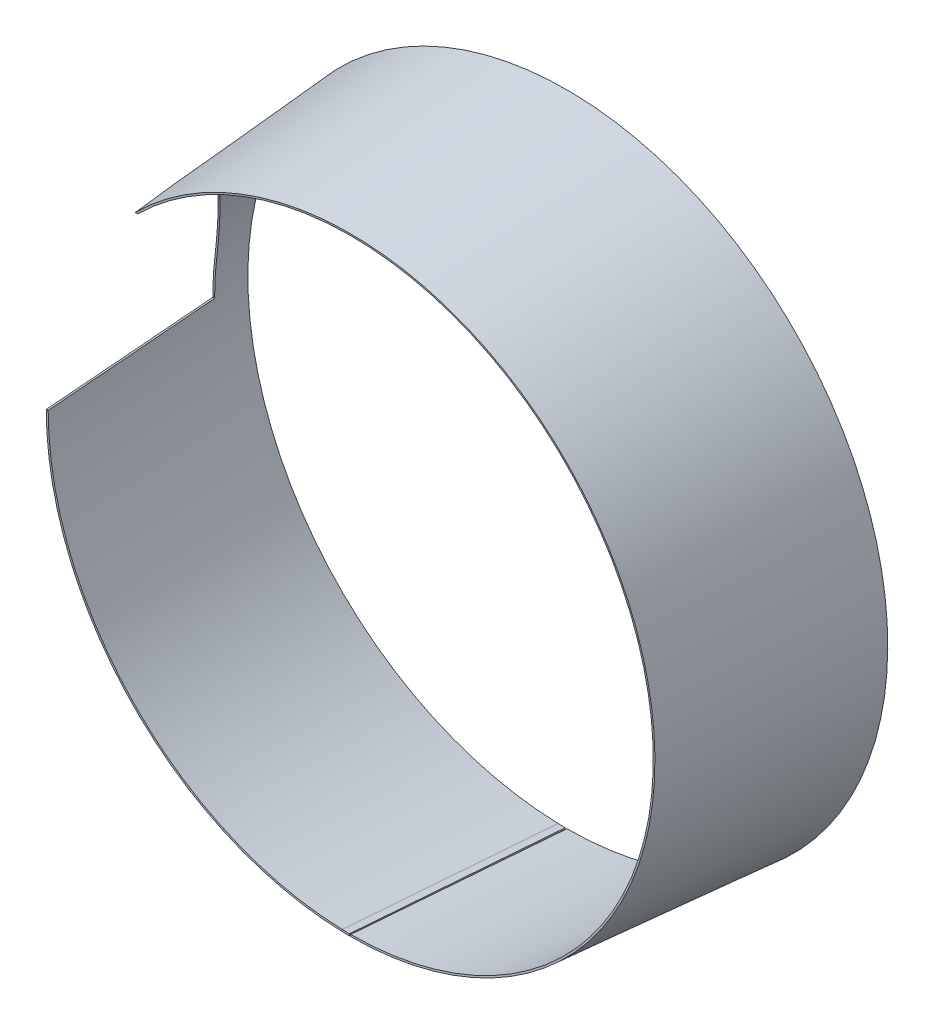
ISO-10303-21;
HEADER;
FILE_DESCRIPTION(('STEP AP214'),'2;1');
FILE_NAME('part.step','',(''),(''),'','','');
FILE_SCHEMA(('AUTOMOTIVE_DESIGN { 1 0 10303 214 1 1 1 1 }'));
ENDSEC;
DATA;
#1=APPLICATION_CONTEXT('core data for automotive mechanical design processes');
#2=APPLICATION_PROTOCOL_DEFINITION('international standard','automotive_design',2000,#1);
#3=PRODUCT_CONTEXT('',#1,'mechanical');
#4=PRODUCT('Part','Part','',(#3));
#5=PRODUCT_RELATED_PRODUCT_CATEGORY('part','',(#4));
#6=PRODUCT_DEFINITION_FORMATION('','',#4);
#7=PRODUCT_DEFINITION_CONTEXT('part definition',#1,'design');
#8=PRODUCT_DEFINITION('design','',#6,#7);
#9=PRODUCT_DEFINITION_SHAPE('','',#8);
#10=(LENGTH_UNIT() NAMED_UNIT(*) SI_UNIT(.MILLI.,.METRE.));
#11=(NAMED_UNIT(*) PLANE_ANGLE_UNIT() SI_UNIT($,.RADIAN.));
#12=(NAMED_UNIT(*) SI_UNIT($,.STERADIAN.) SOLID_ANGLE_UNIT());
#13=UNCERTAINTY_MEASURE_WITH_UNIT(LENGTH_MEASURE(1.E-05),#10,'distance_accuracy_value','');
#14=(GEOMETRIC_REPRESENTATION_CONTEXT(3) GLOBAL_UNCERTAINTY_ASSIGNED_CONTEXT((#13)) GLOBAL_UNIT_ASSIGNED_CONTEXT((#10,
#11,#12)) REPRESENTATION_CONTEXT('',''));
#15=CARTESIAN_POINT('',(0.,0.,0.));
#16=DIRECTION('',(0.,0.,1.));
#17=DIRECTION('',(1.,0.,0.));
#18=AXIS2_PLACEMENT_3D('',#15,#16,#17);
#19=CARTESIAN_POINT('',(0.,0.,241.5));
#20=DIRECTION('',(0.,0.,1.));
#21=DIRECTION('',(1.,0.,0.));
#22=AXIS2_PLACEMENT_3D('',#19,#20,#21);
#23=CONICAL_SURFACE('',#22,339.9,1.494341091626);
#24=DIRECTION('',(0.997078721927596,0.,-0.0763807716590501));
#25=VECTOR('',#24,1.);
#26=CARTESIAN_POINT('',(0.,0.,215.462111801242));
#27=LINE('',#26,#25);
#28=CARTESIAN_POINT('',(-337.905842556145,0.,241.347238456682));
#29=VERTEX_POINT('',#28);
#30=CARTESIAN_POINT('',(-339.9,0.,241.5));
#31=VERTEX_POINT('',#30);
#32=EDGE_CURVE('E225',#29,#31,#27,.F.);
#33=ORIENTED_EDGE('',*,*,#32,.T.);
#34=CARTESIAN_POINT('',(0.,0.,241.5));
#35=DIRECTION('',(0.,0.,1.));
#36=DIRECTION('',(1.,0.,0.));
#37=AXIS2_PLACEMENT_3D('',#34,#35,#36);
#38=CIRCLE('',#37,339.9);
#39=CARTESIAN_POINT('',(-9.48289401400218,-339.767692285654,241.5));
#40=VERTEX_POINT('',#39);
#41=EDGE_CURVE('E137',#31,#40,#38,.T.);
#42=ORIENTED_EDGE('',*,*,#41,.T.);
#43=DIRECTION('',(0.0278175694135114,0.996690604226152,-0.0763807716590499));
#44=VECTOR('',#43,1.);
#45=CARTESIAN_POINT('',(-9.48289401400218,-339.767692285654,241.5));
#46=LINE('',#45,#44);
#47=CARTESIAN_POINT('',(-9.42725887517516,-337.774311077202,241.347238456682));
#48=VERTEX_POINT('',#47);
#49=EDGE_CURVE('E52',#40,#48,#46,.T.);
#50=ORIENTED_EDGE('',*,*,#49,.T.);
#51=CARTESIAN_POINT('',(0.,0.,241.347238456682));
#52=DIRECTION('',(0.,0.,-1.));
#53=DIRECTION('',(-1.,0.,0.));
#54=AXIS2_PLACEMENT_3D('',#51,#52,#53);
#55=CIRCLE('',#54,337.905842556145);
#56=EDGE_CURVE('E135',#29,#48,#55,.F.);
#57=ORIENTED_EDGE('',*,*,#56,.F.);
#58=EDGE_LOOP('',(#33,#42,#50,#57));
#59=FACE_BOUND('',#58,.T.);
#60=ADVANCED_FACE('F43',(#59),#23,.F.);
#61=CARTESIAN_POINT('',(-543.840220596724,240.,260.999134219773));
#62=CARTESIAN_POINT('',(-537.646215797835,240.,260.565039646966));
#63=CARTESIAN_POINT('',(-531.452127179241,240.,260.132141443949));
#64=CARTESIAN_POINT('',(-519.063766615592,240.,259.268971534473));
#65=CARTESIAN_POINT('',(-512.869494670526,240.,258.838699828158));
#66=CARTESIAN_POINT('',(-494.286373475592,240.,257.552174616955));
#67=CARTESIAN_POINT('',(-481.897226718803,240.,256.700211570756));
#68=CARTESIAN_POINT('',(-457.117966386083,240.,255.010026911484));
#69=CARTESIAN_POINT('',(-444.727852807984,240.,254.171805330178));
#70=CARTESIAN_POINT('',(-419.946509401767,240.,252.512028451491));
#71=CARTESIAN_POINT('',(-407.555279573799,240.,251.69047315187));
#72=CARTESIAN_POINT('',(-382.756646163067,240.,250.06678660429));
#73=CARTESIAN_POINT('',(-370.349240978413,240.,249.264679790125));
#74=CARTESIAN_POINT('',(-345.53281798465,240.,247.685699005837));
#75=CARTESIAN_POINT('',(-333.12380017536,240.,246.908825038545));
#76=CARTESIAN_POINT('',(-314.50875632746,240.,245.76712813447));
#77=CARTESIAN_POINT('',(-308.303453939054,240.,245.390496121665));
#78=CARTESIAN_POINT('',(-295.892319477723,240.,244.646069547473));
#79=CARTESIAN_POINT('',(-289.686487404892,240.,244.278274984546));
#80=CARTESIAN_POINT('',(-277.274241678665,240.,243.552588125492));
#81=CARTESIAN_POINT('',(-271.067828025076,240.,243.194695832693));
#82=CARTESIAN_POINT('',(-258.654368708563,240.,242.490030368996));
#83=CARTESIAN_POINT('',(-252.447323045637,240.,242.143257198148));
#84=CARTESIAN_POINT('',(-240.050513368498,240.,241.463190242762));
#85=CARTESIAN_POINT('',(-233.860751338144,240.,241.129860346126));
#86=CARTESIAN_POINT('',(-221.480490214901,240.,240.477157495979));
#87=CARTESIAN_POINT('',(-215.289991122008,240.,240.15778454258));
#88=CARTESIAN_POINT('',(-202.908196988608,240.,239.534713561634));
#89=CARTESIAN_POINT('',(-196.716901947404,240.,239.231015547928));
#90=CARTESIAN_POINT('',(-184.333473097787,240.,238.641201089516));
#91=CARTESIAN_POINT('',(-178.14133928937,240.,238.355084644926));
#92=CARTESIAN_POINT('',(-165.756228277715,240.,237.802525588066));
#93=CARTESIAN_POINT('',(-159.563251079989,240.,237.536082852889));
#94=CARTESIAN_POINT('',(-147.176392633737,240.,237.025124379989));
#95=CARTESIAN_POINT('',(-140.982511384531,240.,236.780608658873));
#96=CARTESIAN_POINT('',(-122.399485772452,240.,236.083536833456));
#97=CARTESIAN_POINT('',(-110.008924306537,240.,235.6674544681));
#98=CARTESIAN_POINT('',(-91.4236888474713,240.,235.131049828325));
#99=CARTESIAN_POINT('',(-85.2302598562439,240.,234.966898185531));
#100=CARTESIAN_POINT('',(-72.8426394334188,240.,234.67007531818));
#101=CARTESIAN_POINT('',(-66.6484480018408,240.,234.537404092812));
#102=CARTESIAN_POINT('',(-54.2594360501224,240.,234.30558795242));
#103=CARTESIAN_POINT('',(-48.0646155300205,240.,234.206443035353));
#104=CARTESIAN_POINT('',(-35.67450986364,240.,234.043324662046));
#105=CARTESIAN_POINT('',(-29.4792247174673,240.,233.97935119781));
#106=CARTESIAN_POINT('',(-17.0885869807392,240.,233.887696859553));
#107=CARTESIAN_POINT('',(-10.8932343990035,240.,233.860014799631));
#108=CARTESIAN_POINT('',(1.49753009656107,240.,233.841438831701));
#109=CARTESIAN_POINT('',(7.69294201042204,240.,233.850544944972));
#110=CARTESIAN_POINT('',(20.0835664601539,240.,233.905379216342));
#111=CARTESIAN_POINT('',(26.2787789969624,240.,233.951107164999));
#112=CARTESIAN_POINT('',(38.6688241320087,240.,234.078372620152));
#113=CARTESIAN_POINT('',(44.8636567310335,240.,234.159910049791));
#114=CARTESIAN_POINT('',(54.2437644154056,240.,234.309427239505));
#115=CARTESIAN_POINT('',(57.4292469085065,240.,234.364753731041));
#116=CARTESIAN_POINT('',(63.8000361891286,240.,234.484259700994));
#117=CARTESIAN_POINT('',(66.9853429771893,240.,234.548439150513));
#118=CARTESIAN_POINT('',(73.3557556245175,240.,234.68538641499));
#119=CARTESIAN_POINT('',(76.5408614847106,240.,234.758154186981));
#120=CARTESIAN_POINT('',(82.9108746892457,240.,234.911988095174));
#121=CARTESIAN_POINT('',(86.095782033417,240.,234.993054238423));
#122=CARTESIAN_POINT('',(95.650847343735,240.,235.248260674254));
#123=CARTESIAN_POINT('',(102.020688104221,240.,235.434394649638));
#124=CARTESIAN_POINT('',(114.759442097386,240.,235.836046990548));
#125=CARTESIAN_POINT('',(121.128355329127,240.,236.05156538557));
#126=CARTESIAN_POINT('',(133.869425706447,240.,236.509461975708));
#127=CARTESIAN_POINT('',(140.241582215871,240.,236.751857819013));
#128=CARTESIAN_POINT('',(152.984933337777,240.,237.260762270586));
#129=CARTESIAN_POINT('',(159.356127949604,240.,237.527270895159));
#130=CARTESIAN_POINT('',(172.096671627331,240.,238.081838650728));
#131=CARTESIAN_POINT('',(178.466020826816,240.,238.369894724413));
#132=CARTESIAN_POINT('',(191.203796551716,240.,238.965296522566));
#133=CARTESIAN_POINT('',(197.572223080261,240.,239.272642180011));
#134=CARTESIAN_POINT('',(203.940220596724,240.,239.588486635848));
#135=B_SPLINE_CURVE_WITH_KNOTS('',3,(#61,#62,#63,#64,#65,#66,#67,#68,#69,#70,#71,#72,#73,#74,
#75,#76,#77,#78,#79,#80,#81,#82,#83,#84,#85,#86,#87,#88,#89,#90,#91,#92,#93,#94,#95,#96,#97,#98,
#99,#100,#101,#102,#103,#104,#105,#106,#107,#108,#109,#110,#111,#112,#113,#114,#115,#116,#117,
#118,#119,#120,#121,#122,#123,#124,#125,#126,#127,#128,#129,#130,#131,#132,#133,#134),
.UNSPECIFIED.,.F.,.F.,(4,2,2,2,2,2,2,2,2,2,2,2,2,2,2,2,2,2,2,2,2,2,2,2,2,2,2,2,2,2,2,2,2,2,2,2,
4),(0.,18.627592266517,37.2551855493778,74.5103957314578,111.765692028904,149.020983318087,
186.320879764651,223.620780396903,242.270940574708,260.921097501024,279.571260697403,
298.221423978873,316.817602209989,335.413780590301,354.009975391076,372.606170314153,
391.202249051697,409.798341872302,446.990421691351,465.577170005147,484.163917840524,
502.750664543436,521.337407020268,539.923542118785,558.509687967379,577.095727521214,
595.681727184981,605.239605735957,614.797453087601,624.355252624011,633.913060277179,
653.030657476456,672.148273866796,691.278518388477,710.408775847658,729.536324094403,
748.663805884229),.UNSPECIFIED.);
#136=CARTESIAN_POINT('',(-240.690693629812,240.,241.5));
#137=VERTEX_POINT('',#136);
#138=CARTESIAN_POINT('',(-237.866261654691,240.,241.347238456682));
#139=VERTEX_POINT('',#138);
#140=EDGE_CURVE('E59',#137,#139,#135,.T.);
#141=ORIENTED_EDGE('',*,*,#140,.T.);
#142=CARTESIAN_POINT('',(0.,-337.905842556145,241.347238456682));
#143=VERTEX_POINT('',#142);
#144=EDGE_CURVE('E167',#143,#139,#55,.F.);
#145=ORIENTED_EDGE('',*,*,#144,.F.);
#146=DIRECTION('',(0.,0.997078721927596,-0.0763807716590501));
#147=VECTOR('',#146,1.);
#148=CARTESIAN_POINT('',(0.,-339.9,241.5));
#149=LINE('',#148,#147);
#150=CARTESIAN_POINT('',(0.,-339.9,241.5));
#151=VERTEX_POINT('',#150);
#152=EDGE_CURVE('E12',#151,#143,#149,.T.);
#153=ORIENTED_EDGE('',*,*,#152,.F.);
#154=EDGE_CURVE('E165',#151,#137,#38,.T.);
#155=ORIENTED_EDGE('',*,*,#154,.T.);
#156=EDGE_LOOP('',(#141,#145,#153,#155));
#157=FACE_BOUND('',#156,.T.);
#158=ADVANCED_FACE('F272',(#157),#23,.F.);
#159=CARTESIAN_POINT('',(-9.48289401400207,-339.767692285655,241.5));
#160=DIRECTION('',(0.00213095252236009,0.0763510400752954,0.997078721927596));
#161=DIRECTION('',(0.999610745176977,-0.0278990703559828,0.));
#162=AXIS2_PLACEMENT_3D('',#159,#160,#161);
#163=PLANE('',#162);
#164=ORIENTED_EDGE('',*,*,#49,.F.);
#165=DIRECTION('',(0.999610745176977,-0.0278990703559828,0.));
#166=VECTOR('',#165,1.);
#167=CARTESIAN_POINT('',(-9.48289401400207,-339.767692285655,241.5));
#168=LINE('',#167,#166);
#169=CARTESIAN_POINT('',(-1.48600805258626,-339.990884848502,241.5));
#170=VERTEX_POINT('',#169);
#171=EDGE_CURVE('E114',#40,#170,#168,.T.);
#172=ORIENTED_EDGE('',*,*,#171,.T.);
#173=DIRECTION('',(0.0278175694135114,0.996690604226152,-0.0763807716590499));
#174=VECTOR('',#173,1.);
#175=CARTESIAN_POINT('',(-1.48600805258626,-339.990884848502,241.5));
#176=LINE('',#175,#174);
#177=CARTESIAN_POINT('',(-1.43037291375924,-337.99750364005,241.347238456682));
#178=VERTEX_POINT('',#177);
#179=EDGE_CURVE('E95',#170,#178,#176,.T.);
#180=ORIENTED_EDGE('',*,*,#179,.T.);
#181=DIRECTION('',(0.999610745176977,-0.0278990703559828,0.));
#182=VECTOR('',#181,1.);
#183=CARTESIAN_POINT('',(-9.42725887517505,-337.774311077202,241.347238456682));
#184=LINE('',#183,#182);
#185=EDGE_CURVE('E139',#48,#178,#184,.T.);
#186=ORIENTED_EDGE('',*,*,#185,.F.);
#187=EDGE_LOOP('',(#164,#172,#180,#186));
#188=FACE_BOUND('',#187,.T.);
#189=ADVANCED_FACE('F119',(#188),#163,.T.);
#190=CARTESIAN_POINT('',(-1.99902681558801,-358.483770546889,0.));
#191=DIRECTION('',(-0.99961077250241,0.0278980883336495,-1.28243344317126E-05));
#192=DIRECTION('',(0.00211809562110294,0.0763513989042463,0.997078721845123));
#193=AXIS2_PLACEMENT_3D('',#190,#191,#192);
#194=PLANE('',#193);
#195=ORIENTED_EDGE('',*,*,#179,.F.);
#196=DIRECTION('',(0.00211809562110294,0.0763513989042463,0.997078721845123));
#197=VECTOR('',#196,1.);
#198=CARTESIAN_POINT('',(-1.99902681558801,-358.483770546889,0.));
#199=LINE('',#198,#197);
#200=CARTESIAN_POINT('',(-1.99902681558801,-358.483770546889,0.));
#201=VERTEX_POINT('',#200);
#202=EDGE_CURVE('E99',#201,#170,#199,.T.);
#203=ORIENTED_EDGE('',*,*,#202,.F.);
#204=DIRECTION('',(0.0278175694135114,0.996690604226152,-0.0763807716590499));
#205=VECTOR('',#204,1.);
#206=CARTESIAN_POINT('',(-1.99902681558801,-358.483770546889,0.));
#207=LINE('',#206,#205);
#208=CARTESIAN_POINT('',(-1.94339167676099,-356.490389338437,-0.152761543318091));
#209=VERTEX_POINT('',#208);
#210=EDGE_CURVE('E107',#201,#209,#207,.T.);
#211=ORIENTED_EDGE('',*,*,#210,.T.);
#212=DIRECTION('',(0.00211809562110294,0.0763513989042463,0.997078721845123));
#213=VECTOR('',#212,1.);
#214=CARTESIAN_POINT('',(-1.94339167676099,-356.490389338437,-0.152761543318102));
#215=LINE('',#214,#213);
#216=EDGE_CURVE('E102',#209,#178,#215,.T.);
#217=ORIENTED_EDGE('',*,*,#216,.T.);
#218=EDGE_LOOP('',(#195,#203,#211,#217));
#219=FACE_BOUND('',#218,.T.);
#220=ADVANCED_FACE('F97',(#219),#194,.F.);
#221=CARTESIAN_POINT('',(-9.99902681558802,-358.260491071429,0.));
#222=DIRECTION('',(0.00213095252236022,0.0763510400752954,0.997078721927596));
#223=DIRECTION('',(0.999610745176977,-0.0278990703559844,0.));
#224=AXIS2_PLACEMENT_3D('',#221,#222,#223);
#225=PLANE('',#224);
#226=ORIENTED_EDGE('',*,*,#210,.F.);
#227=DIRECTION('',(0.999610745176977,-0.0278990703559844,0.));
#228=VECTOR('',#227,1.);
#229=CARTESIAN_POINT('',(-9.99902681558802,-358.260491071429,0.));
#230=LINE('',#229,#228);
#231=CARTESIAN_POINT('',(-9.99902681558806,-358.260491071429,0.));
#232=VERTEX_POINT('',#231);
#233=EDGE_CURVE('E116',#232,#201,#230,.T.);
#234=ORIENTED_EDGE('',*,*,#233,.F.);
#235=DIRECTION('',(0.027817569413522,0.996690604226152,-0.0763807716590501));
#236=VECTOR('',#235,1.);
#237=CARTESIAN_POINT('',(-9.99902681558806,-358.260491071429,0.));
#238=LINE('',#237,#236);
#239=CARTESIAN_POINT('',(-9.94339167676104,-356.267109862976,-0.152761543318093));
#240=VERTEX_POINT('',#239);
#241=EDGE_CURVE('E127',#232,#240,#238,.T.);
#242=ORIENTED_EDGE('',*,*,#241,.T.);
#243=DIRECTION('',(0.999610745176977,-0.0278990703559844,0.));
#244=VECTOR('',#243,1.);
#245=CARTESIAN_POINT('',(-9.94339167676099,-356.267109862976,-0.152761543318102));
#246=LINE('',#245,#244);
#247=EDGE_CURVE('E142',#240,#209,#246,.T.);
#248=ORIENTED_EDGE('',*,*,#247,.T.);
#249=EDGE_LOOP('',(#226,#234,#242,#248));
#250=FACE_BOUND('',#249,.T.);
#251=ADVANCED_FACE('F184',(#250),#225,.F.);
#252=CARTESIAN_POINT('',(0.,0.,0.));
#253=DIRECTION('',(0.,0.,1.));
#254=DIRECTION('',(1.,0.,0.));
#255=AXIS2_PLACEMENT_3D('',#252,#253,#254);
#256=CONICAL_SURFACE('',#255,358.4,1.494341091626);
#257=ORIENTED_EDGE('',*,*,#241,.F.);
#258=CARTESIAN_POINT('',(0.,0.,0.));
#259=DIRECTION('',(0.,0.,1.));
#260=DIRECTION('',(1.,0.,0.));
#261=AXIS2_PLACEMENT_3D('',#258,#259,#260);
#262=CIRCLE('',#261,358.4);
#263=CARTESIAN_POINT('',(0.,-358.4,0.));
#264=VERTEX_POINT('',#263);
#265=EDGE_CURVE('E173',#264,#232,#262,.T.);
#266=ORIENTED_EDGE('',*,*,#265,.F.);
#267=DIRECTION('',(0.,0.997078721927596,-0.0763807716590501));
#268=VECTOR('',#267,1.);
#269=CARTESIAN_POINT('',(0.,-358.4,0.));
#270=LINE('',#269,#268);
#271=CARTESIAN_POINT('',(0.,-356.405842556145,-0.152761543318099));
#272=VERTEX_POINT('',#271);
#273=EDGE_CURVE('E47',#264,#272,#270,.T.);
#274=ORIENTED_EDGE('',*,*,#273,.T.);
#275=CARTESIAN_POINT('',(0.,0.,-0.152761543318099));
#276=DIRECTION('',(0.,0.,-1.));
#277=DIRECTION('',(-1.,0.,0.));
#278=AXIS2_PLACEMENT_3D('',#275,#276,#277);
#279=CIRCLE('',#278,356.405842556145);
#280=EDGE_CURVE('E152',#272,#240,#279,.F.);
#281=ORIENTED_EDGE('',*,*,#280,.T.);
#282=EDGE_LOOP('',(#257,#266,#274,#281));
#283=FACE_BOUND('',#282,.T.);
#284=ADVANCED_FACE('F274',(#283),#256,.T.);
#285=CARTESIAN_POINT('',(0.,-358.4,0.));
#286=DIRECTION('',(1.,0.,0.));
#287=DIRECTION('',(0.,0.0763807716590501,0.997078721927596));
#288=AXIS2_PLACEMENT_3D('',#285,#286,#287);
#289=PLANE('',#288);
#290=DIRECTION('',(0.,0.0763807716590501,0.997078721927596));
#291=VECTOR('',#290,1.);
#292=CARTESIAN_POINT('',(0.,-358.4,0.));
#293=LINE('',#292,#291);
#294=EDGE_CURVE('E171',#264,#151,#293,.T.);
#295=ORIENTED_EDGE('',*,*,#294,.T.);
#296=ORIENTED_EDGE('',*,*,#152,.T.);
#297=DIRECTION('',(0.,-0.0763807716590501,-0.997078721927596));
#298=VECTOR('',#297,1.);
#299=CARTESIAN_POINT('',(0.,-356.405842556145,-0.1527615433181));
#300=LINE('',#299,#298);
#301=EDGE_CURVE('E154',#272,#143,#300,.F.);
#302=ORIENTED_EDGE('',*,*,#301,.F.);
#303=ORIENTED_EDGE('',*,*,#273,.F.);
#304=EDGE_LOOP('',(#295,#296,#302,#303));
#305=FACE_BOUND('',#304,.T.);
#306=ADVANCED_FACE('F45',(#305),#289,.F.);
#307=CARTESIAN_POINT('',(0.,0.,-0.1527615433181));
#308=DIRECTION('',(0.,0.,-1.));
#309=DIRECTION('',(-1.,0.,0.));
#310=AXIS2_PLACEMENT_3D('',#307,#308,#309);
#311=CONICAL_SURFACE('',#310,356.405842556145,0.0764552351688992);
#312=DIRECTION('',(-0.0763807716590501,0.,-0.997078721927596));
#313=VECTOR('',#312,1.);
#314=CARTESIAN_POINT('',(0.,-6.76861898362916E-13,4652.38837236526));
#315=LINE('',#314,#313);
#316=CARTESIAN_POINT('',(-353.329958131501,0.,40.0000000000001));
#317=VERTEX_POINT('',#316);
#318=EDGE_CURVE('E220',#317,#29,#315,.F.);
#319=ORIENTED_EDGE('',*,*,#318,.T.);
#320=ORIENTED_EDGE('',*,*,#56,.T.);
#321=DIRECTION('',(-0.00213095252236093,-0.0763510400752956,-0.997078721927596));
#322=VECTOR('',#321,1.);
#323=CARTESIAN_POINT('',(-9.94339167676111,-356.267109862976,-0.1527615433181));
#324=LINE('',#323,#322);
#325=EDGE_CURVE('E146',#240,#48,#324,.F.);
#326=ORIENTED_EDGE('',*,*,#325,.F.);
#327=ORIENTED_EDGE('',*,*,#280,.F.);
#328=ORIENTED_EDGE('',*,*,#301,.T.);
#329=ORIENTED_EDGE('',*,*,#144,.T.);
#330=CARTESIAN_POINT('',(-161.057756729506,240.,879.346672928448));
#331=CARTESIAN_POINT('',(-162.581764161245,240.,868.260492081893));
#332=CARTESIAN_POINT('',(-164.091228437712,240.,857.172317973561));
#333=CARTESIAN_POINT('',(-167.083155367084,240.,834.992338090914));
#334=CARTESIAN_POINT('',(-168.565618047567,240.,823.900532320321));
#335=CARTESIAN_POINT('',(-171.505621857814,240.,801.713679573142));
#336=CARTESIAN_POINT('',(-172.963163118395,240.,790.618632613881));
#337=CARTESIAN_POINT('',(-175.855109659939,240.,768.425522781952));
#338=CARTESIAN_POINT('',(-177.289514934209,240.,757.327459908412));
#339=CARTESIAN_POINT('',(-181.560438041611,240.,724.029552399986));
#340=CARTESIAN_POINT('',(-184.36471879637,240.,701.825568030029));
#341=CARTESIAN_POINT('',(-189.898308888849,240.,657.408243361391));
#342=CARTESIAN_POINT('',(-192.627618110569,240.,635.194903048288));
#343=CARTESIAN_POINT('',(-198.020024113377,240.,590.761366039557));
#344=CARTESIAN_POINT('',(-200.68312433215,240.,568.541169760807));
#345=CARTESIAN_POINT('',(-205.950660404845,240.,524.093840838631));
#346=CARTESIAN_POINT('',(-208.555096283732,240.,501.866708198161));
#347=CARTESIAN_POINT('',(-213.711516910172,240.,457.406288802446));
#348=CARTESIAN_POINT('',(-216.263501481164,240.,435.173002026741));
#349=CARTESIAN_POINT('',(-221.320276321987,240.,390.701068336075));
#350=CARTESIAN_POINT('',(-223.825066601155,240.,368.462421422175));
#351=CARTESIAN_POINT('',(-227.274759448738,240.,337.567869553406));
#352=CARTESIAN_POINT('',(-228.237781773979,240.,328.913983882255));
#353=CARTESIAN_POINT('',(-230.157593760954,240.,311.605530581409));
#354=CARTESIAN_POINT('',(-231.114383429492,240.,302.950962952468));
#355=CARTESIAN_POINT('',(-233.975758450524,240.,276.986180829358));
#356=CARTESIAN_POINT('',(-235.871340144735,240.,259.674973775912));
#357=CARTESIAN_POINT('',(-240.648382432695,240.,215.78763736811));
#358=CARTESIAN_POINT('',(-243.514704536001,240.,189.209859835797));
#359=CARTESIAN_POINT('',(-249.200042931942,240.,136.049240990704));
#360=CARTESIAN_POINT('',(-252.019059208907,240.,109.46639967625));
#361=CARTESIAN_POINT('',(-257.614306349982,240.,56.2961581951379));
#362=CARTESIAN_POINT('',(-260.390537121229,240.,29.7087580187124));
#363=CARTESIAN_POINT('',(-265.904115955675,240.,-23.4700741407788));
#364=CARTESIAN_POINT('',(-268.641464015489,240.,-50.0615061241952));
#365=CARTESIAN_POINT('',(-274.080622168583,240.,-103.247440851145));
#366=CARTESIAN_POINT('',(-276.782433004151,240.,-129.841943518797));
#367=CARTESIAN_POINT('',(-282.153551039514,240.,-183.034232577149));
#368=CARTESIAN_POINT('',(-284.822858236002,240.,-209.632018968182));
#369=CARTESIAN_POINT('',(-290.131593733517,240.,-262.830423238444));
#370=CARTESIAN_POINT('',(-292.771022200108,240.,-289.431041101158));
#371=CARTESIAN_POINT('',(-298.022285857229,240.,-342.634991887732));
#372=CARTESIAN_POINT('',(-300.634121056808,240.,-369.238324810698));
#373=CARTESIAN_POINT('',(-303.233295773689,240.,-395.842892058567));
#374=B_SPLINE_CURVE_WITH_KNOTS('',3,(#330,#331,#332,#333,#334,#335,#336,#337,#338,#339,#340,
#341,#342,#343,#344,#345,#346,#347,#348,#349,#350,#351,#352,#353,#354,#355,#356,#357,#358,#359,
#360,#361,#362,#363,#364,#365,#366,#367,#368,#369,#370,#371,#372,#373),.UNSPECIFIED.,.F.,.F.,(4,
2,2,2,2,2,2,2,2,2,2,2,2,2,2,2,2,2,2,2,2,4),(0.,33.571309299136,67.1425843101541,
100.713683044861,134.284791492603,201.425734870211,268.566782126862,335.704335993725,
402.841861290423,469.979612548718,537.117350525604,563.239262071252,589.361145090089,
641.605172773009,721.800799277013,801.996452345226,882.192279447541,962.388113528504,
1042.5822698367,1122.77643430051,1202.97015417142,1283.16384774102),.UNSPECIFIED.);
#375=CARTESIAN_POINT('',(-238.012848310633,240.,240.000000000001));
#376=VERTEX_POINT('',#375);
#377=EDGE_CURVE('E239',#139,#376,#374,.T.);
#378=ORIENTED_EDGE('',*,*,#377,.T.);
#379=CARTESIAN_POINT('',(-238.012826553057,239.9999999999,240.000200000001));
#380=CARTESIAN_POINT('',(-238.151664169441,240.000004184882,238.723893033011));
#381=CARTESIAN_POINT('',(-238.302627335958,239.987784390275,237.448973737179));
#382=CARTESIAN_POINT('',(-238.628354079354,239.939087316741,234.902674371969));
#383=CARTESIAN_POINT('',(-238.803117060767,239.902610644626,233.631294214855));
#384=CARTESIAN_POINT('',(-239.362323281523,239.757110733759,229.824314414939));
#385=CARTESIAN_POINT('',(-239.781772079668,239.61201735805,227.295068191574));
#386=CARTESIAN_POINT('',(-240.708274758523,239.228116342864,222.265684566022));
#387=CARTESIAN_POINT('',(-241.215139047102,238.989510123565,219.76549641375));
#388=CARTESIAN_POINT('',(-242.311656518273,238.42102537831,214.79370394375));
#389=CARTESIAN_POINT('',(-242.901314395911,238.091141675177,212.32210125565));
#390=CARTESIAN_POINT('',(-244.150548968362,237.346904294927,207.438770963954));
#391=CARTESIAN_POINT('',(-244.809297064724,236.933506575738,205.026684636552));
#392=CARTESIAN_POINT('',(-246.195736659943,236.022871324703,200.238550579169));
#393=CARTESIAN_POINT('',(-246.923426695686,235.525635571926,197.862502085621));
#394=CARTESIAN_POINT('',(-248.441987092742,234.449786415237,193.147778012726));
#395=CARTESIAN_POINT('',(-249.232894595729,233.871125017859,190.809125386963));
#396=CARTESIAN_POINT('',(-250.871353402416,232.635353104018,186.172709370834));
#397=CARTESIAN_POINT('',(-251.718907538927,231.978238662945,183.874948032664));
#398=CARTESIAN_POINT('',(-253.654831989591,230.436692821245,178.825908084713));
#399=CARTESIAN_POINT('',(-254.755434956288,229.533928647198,176.084902341998));
#400=CARTESIAN_POINT('',(-257.021283313873,227.62021849951,170.668149137111));
#401=CARTESIAN_POINT('',(-258.186532116814,226.609266813034,167.99240513025));
#402=CARTESIAN_POINT('',(-260.571926222607,224.483027417563,162.707530694596));
#403=CARTESIAN_POINT('',(-261.79207498516,223.367733128284,160.098404480227));
#404=CARTESIAN_POINT('',(-264.27805323071,221.036310679228,154.94798732422));
#405=CARTESIAN_POINT('',(-265.543882094685,219.820183885563,152.406695464155));
#406=CARTESIAN_POINT('',(-268.118741675353,217.284175609874,147.380994745585));
#407=CARTESIAN_POINT('',(-269.427945787329,215.963838325841,144.896905027238));
#408=CARTESIAN_POINT('',(-272.075977912884,213.226957216017,139.99853759686));
#409=CARTESIAN_POINT('',(-273.414806033211,211.810413043515,137.584260136465));
#410=CARTESIAN_POINT('',(-276.114599092897,208.883414366586,132.826341360192));
#411=CARTESIAN_POINT('',(-277.47556259145,207.372965956524,130.482695474967));
#412=CARTESIAN_POINT('',(-280.212807287115,204.259939521149,125.866648356897));
#413=CARTESIAN_POINT('',(-281.589088493243,202.657361441603,123.594247165991));
#414=CARTESIAN_POINT('',(-284.372449245906,199.33544088974,119.086058753596));
#415=CARTESIAN_POINT('',(-285.779670471018,197.614646618972,116.851428829355));
#416=CARTESIAN_POINT('',(-288.596797556966,194.081023964223,112.457907324354));
#417=CARTESIAN_POINT('',(-290.006703425814,192.268195305147,110.299015970013));
#418=CARTESIAN_POINT('',(-292.823115451397,188.551677996649,106.05841571644));
#419=CARTESIAN_POINT('',(-294.229621473445,186.647985807652,103.976709829578));
#420=CARTESIAN_POINT('',(-297.033268236528,182.750940540431,99.8924128159008));
#421=CARTESIAN_POINT('',(-298.430409001248,180.757587689063,97.8898214889363));
#422=CARTESIAN_POINT('',(-301.207611452744,176.685201790684,93.9687226561052));
#423=CARTESIAN_POINT('',(-302.587694663889,174.606295051429,92.0500992551466));
#424=CARTESIAN_POINT('',(-305.327227271071,170.361219531909,88.2964071634706));
#425=CARTESIAN_POINT('',(-306.686676566845,168.195050327814,86.461338878669));
#426=CARTESIAN_POINT('',(-309.379310152856,163.776814627207,82.8777860964104));
#427=CARTESIAN_POINT('',(-310.712496621691,161.524755301489,81.129294398737));
#428=CARTESIAN_POINT('',(-313.347243914715,156.935908905425,77.7219680574103));
#429=CARTESIAN_POINT('',(-314.648805346642,154.599123465417,76.0631316900966));
#430=CARTESIAN_POINT('',(-317.094588499262,150.065332114149,72.9898106996242));
#431=CARTESIAN_POINT('',(-318.242122657507,147.875755398417,71.5669966831938));
#432=CARTESIAN_POINT('',(-320.502710277599,143.429644403097,68.8008081192215));
#433=CARTESIAN_POINT('',(-321.615764295465,141.173111204383,67.457432290361));
#434=CARTESIAN_POINT('',(-323.803377682684,136.594647129581,64.8531750563945));
#435=CARTESIAN_POINT('',(-324.877936591539,134.272715471755,63.5922946379923));
#436=CARTESIAN_POINT('',(-326.984519576105,129.565380701477,61.1563093121099));
#437=CARTESIAN_POINT('',(-328.016543643615,127.179977576787,59.9812044211682));
#438=CARTESIAN_POINT('',(-330.032205246537,122.35237066079,57.7222555385444));
#439=CARTESIAN_POINT('',(-331.01592774052,119.910278608368,56.6382487332791));
#440=CARTESIAN_POINT('',(-332.933038328302,114.967779953798,54.5626366039734));
#441=CARTESIAN_POINT('',(-333.866427432217,112.467374523355,53.5710294253221));
#442=CARTESIAN_POINT('',(-335.678927280275,107.411530227437,51.6838678637476));
#443=CARTESIAN_POINT('',(-336.558043336044,104.856096780598,50.7883040748524));
#444=CARTESIAN_POINT('',(-338.258309438558,99.6935537558578,49.0967336422809));
#445=CARTESIAN_POINT('',(-339.079461890924,97.0864463283012,48.3007228658724));
#446=CARTESIAN_POINT('',(-340.520075099982,92.2910477432898,46.9437722907078));
#447=CARTESIAN_POINT('',(-341.149485523332,90.1104392815366,46.3661757111054));
#448=CARTESIAN_POINT('',(-342.364791331004,85.7192815264617,45.2826113258802));
#449=CARTESIAN_POINT('',(-342.95068367864,83.5087301564291,44.7766485166257));
#450=CARTESIAN_POINT('',(-344.076978486294,79.0610921607604,43.8383435394576));
#451=CARTESIAN_POINT('',(-344.617390670658,76.8240113248304,43.4059856133832));
#452=CARTESIAN_POINT('',(-345.651161626623,72.3260449196631,42.6165153826213));
#453=CARTESIAN_POINT('',(-346.144524948929,70.0651616762008,42.2593957966124));
#454=CARTESIAN_POINT('',(-347.085162961947,65.5109553563556,41.620300063482));
#455=CARTESIAN_POINT('',(-347.532188700781,63.21752544758,41.3387180815659));
#456=CARTESIAN_POINT('',(-348.375918095151,58.6131528756336,40.8545520218488));
#457=CARTESIAN_POINT('',(-348.772622359183,56.3022104245858,40.6519669887417));
#458=CARTESIAN_POINT('',(-349.514821549903,51.6649431748819,40.3269329155364));
#459=CARTESIAN_POINT('',(-349.860283032782,49.3386093564345,40.2045360340889));
#460=CARTESIAN_POINT('',(-350.498866973335,44.6758067843197,40.0410441770275));
#461=CARTESIAN_POINT('',(-350.791986740574,42.3393375159955,39.9999533795646));
#462=CARTESIAN_POINT('',(-351.058506965952,39.9998,40.0000000001002));
#463=B_SPLINE_CURVE_WITH_KNOTS('',3,(#379,#380,#381,#382,#383,#384,#385,#386,#387,#388,#389,
#390,#391,#392,#393,#394,#395,#396,#397,#398,#399,#400,#401,#402,#403,#404,#405,#406,#407,#408,
#409,#410,#411,#412,#413,#414,#415,#416,#417,#418,#419,#420,#421,#422,#423,#424,#425,#426,#427,
#428,#429,#430,#431,#432,#433,#434,#435,#436,#437,#438,#439,#440,#441,#442,#443,#444,#445,#446,
#447,#448,#449,#450,#451,#452,#453,#454,#455,#456,#457,#458,#459,#460,#461,#462),.UNSPECIFIED.,
.F.,.F.,(4,2,2,2,2,2,2,2,2,2,2,2,2,2,2,2,2,2,2,2,2,2,2,2,2,2,2,2,2,2,2,2,2,2,2,2,2,2,2,2,2,4),
(0.,3.85126171697154,7.70242709413509,15.4023247503581,23.085727714826,30.7695665645298,
38.369983438292,45.9702390491489,53.5749932736561,61.1801280850585,70.4423611079597,
79.7050834639611,88.9683903604581,98.231571775,107.537790752758,116.844043270097,
126.149692442809,135.455347093442,144.909017149508,154.362715464716,163.816782348229,
173.270825312683,182.711379117424,192.151978780079,201.591791983856,211.031423638757,
219.586236228727,228.140910794004,236.69568766058,245.250466176622,253.789614882438,
262.328592156711,270.866732404416,279.404518091595,286.428830610168,293.453632824883,
300.476929194453,307.499545559735,314.558123880915,321.616616840407,328.67969647384,
335.743139054869),.UNSPECIFIED.);
#464=CARTESIAN_POINT('',(-351.058484177791,40.,40.0000000000001));
#465=VERTEX_POINT('',#464);
#466=EDGE_CURVE('E235',#376,#465,#463,.T.);
#467=ORIENTED_EDGE('',*,*,#466,.T.);
#468=CARTESIAN_POINT('',(0.,0.,40.0000000000001));
#469=DIRECTION('',(0.,0.,-1.));
#470=DIRECTION('',(0.,1.,0.));
#471=AXIS2_PLACEMENT_3D('',#468,#469,#470);
#472=CIRCLE('',#471,353.329958131501);
#473=EDGE_CURVE('E232',#465,#317,#472,.F.);
#474=ORIENTED_EDGE('',*,*,#473,.T.);
#475=EDGE_LOOP('',(#319,#320,#326,#327,#328,#329,#378,#467,#474));
#476=FACE_BOUND('',#475,.T.);
#477=ADVANCED_FACE('F275',(#476),#311,.F.);
#478=CARTESIAN_POINT('',(-9.88505713154447,-354.177010176297,27.1421374160185));
#479=DIRECTION('',(0.0278175694135114,0.996690604226152,-0.0763807716590499));
#480=DIRECTION('',(0.,0.0764103411974296,0.997076456325237));
#481=AXIS2_PLACEMENT_3D('',#478,#479,#480);
#482=PLANE('',#481);
#483=ORIENTED_EDGE('',*,*,#216,.F.);
#484=ORIENTED_EDGE('',*,*,#247,.F.);
#485=ORIENTED_EDGE('',*,*,#325,.T.);
#486=ORIENTED_EDGE('',*,*,#185,.T.);
#487=EDGE_LOOP('',(#483,#484,#485,#486));
#488=FACE_BOUND('',#487,.T.);
#489=ADVANCED_FACE('F147',(#488),#482,.T.);
#490=CARTESIAN_POINT('',(0.,0.,0.));
#491=DIRECTION('',(0.,0.,-1.));
#492=DIRECTION('',(-1.,0.,0.));
#493=AXIS2_PLACEMENT_3D('',#490,#491,#492);
#494=CONICAL_SURFACE('',#493,358.4,0.0764552351688992);
#495=ORIENTED_EDGE('',*,*,#41,.F.);
#496=DIRECTION('',(-0.0763807716590501,0.,-0.997078721927596));
#497=VECTOR('',#496,1.);
#498=CARTESIAN_POINT('',(0.,-6.80704453899086E-13,4678.57297297295));
#499=LINE('',#498,#497);
#500=CARTESIAN_POINT('',(-355.335817805383,0.,40.0000000000001));
#501=VERTEX_POINT('',#500);
#502=EDGE_CURVE('E218',#501,#31,#499,.F.);
#503=ORIENTED_EDGE('',*,*,#502,.F.);
#504=CARTESIAN_POINT('',(0.,0.,40.0000000000001));
#505=DIRECTION('',(0.,0.,-1.));
#506=DIRECTION('',(0.,1.,0.));
#507=AXIS2_PLACEMENT_3D('',#504,#505,#506);
#508=CIRCLE('',#507,355.335817805383);
#509=CARTESIAN_POINT('',(-353.07724851004,40.,40.0000000000001));
#510=VERTEX_POINT('',#509);
#511=EDGE_CURVE('E228',#510,#501,#508,.F.);
#512=ORIENTED_EDGE('',*,*,#511,.F.);
#513=CARTESIAN_POINT('',(-240.852914554814,239.9999999999,240.000200000001));
#514=CARTESIAN_POINT('',(-240.991112246027,240.000004135969,238.722201817123));
#515=CARTESIAN_POINT('',(-241.141327186004,239.987752000364,237.445571164172));
#516=CARTESIAN_POINT('',(-241.465350687408,239.938923108942,234.895803892552));
#517=CARTESIAN_POINT('',(-241.639158674286,239.90234694539,233.622667189567));
#518=CARTESIAN_POINT('',(-242.195207178199,239.756443487256,229.810329761754));
#519=CARTESIAN_POINT('',(-242.612158310089,239.610940990914,227.277409906994));
#520=CARTESIAN_POINT('',(-243.533000087581,239.225909983635,222.240360399659));
#521=CARTESIAN_POINT('',(-244.036706329301,238.986579560615,219.736181459444));
#522=CARTESIAN_POINT('',(-245.126328210802,238.416309168957,214.75619248265));
#523=CARTESIAN_POINT('',(-245.712248387911,238.085364143193,212.28038401998));
#524=CARTESIAN_POINT('',(-246.953657488966,237.338606089459,207.388160940816));
#525=CARTESIAN_POINT('',(-247.608332867978,236.923741365168,204.971394104878));
#526=CARTESIAN_POINT('',(-248.98627474916,236.009775160718,200.173735708899));
#527=CARTESIAN_POINT('',(-249.709539826772,235.510675429893,197.79284340496));
#528=CARTESIAN_POINT('',(-251.218969329278,234.430692316904,193.068333841333));
#529=CARTESIAN_POINT('',(-252.005169978945,233.84976168584,190.724738993365));
#530=CARTESIAN_POINT('',(-253.634016006334,232.609032504268,186.078359923442));
#531=CARTESIAN_POINT('',(-254.47666416489,231.949230066957,183.775577719161));
#532=CARTESIAN_POINT('',(-256.398635097461,230.403601174064,178.723041790917));
#533=CARTESIAN_POINT('',(-257.489950556959,229.499651871693,175.983379718048));
#534=CARTESIAN_POINT('',(-259.736776703976,227.58353539564,170.568990552546));
#535=CARTESIAN_POINT('',(-260.892290716974,226.571362613478,167.894266834044));
#536=CARTESIAN_POINT('',(-263.257907733177,224.442625614886,162.611182967905));
#537=CARTESIAN_POINT('',(-264.468014177527,223.326054813128,160.002827019903));
#538=CARTESIAN_POINT('',(-266.93371352146,220.992016673224,154.85377229916));
#539=CARTESIAN_POINT('',(-268.189305818115,219.774550672197,152.31307263039));
#540=CARTESIAN_POINT('',(-270.743439284909,217.235896370652,147.288643377621));
#541=CARTESIAN_POINT('',(-272.042150464126,215.914259616371,144.805227096163));
#542=CARTESIAN_POINT('',(-274.669155208503,213.174745237077,139.908145890025));
#543=CARTESIAN_POINT('',(-275.997448878879,211.756867269726,137.4944812135));
#544=CARTESIAN_POINT('',(-278.676189595431,208.827181640738,132.737776680927));
#545=CARTESIAN_POINT('',(-280.026635225343,207.315379966929,130.394732336804));
#546=CARTESIAN_POINT('',(-282.74290198297,204.199650286878,125.779923441817));
#547=CARTESIAN_POINT('',(-284.108723119274,202.595722229166,123.508158930778));
#548=CARTESIAN_POINT('',(-286.870373670569,199.271970565805,119.002493601518));
#549=CARTESIAN_POINT('',(-288.266341495647,197.550743665714,116.769712858051));
#550=CARTESIAN_POINT('',(-291.061085474954,194.01640724065,112.379912463951));
#551=CARTESIAN_POINT('',(-292.45986163733,192.203297448776,110.222893033421));
#552=CARTESIAN_POINT('',(-295.254169180148,188.486399543305,105.986079592505));
#553=CARTESIAN_POINT('',(-296.649700434955,186.582607978056,103.906288527061));
#554=CARTESIAN_POINT('',(-299.431583719081,182.685574067154,99.8258724900777));
#555=CARTESIAN_POINT('',(-300.817935771098,180.692331942798,97.8252473227093));
#556=CARTESIAN_POINT('',(-303.573832652975,176.620344272651,93.9080712414891));
#557=CARTESIAN_POINT('',(-304.943398236955,174.54172192471,91.9914069013984));
#558=CARTESIAN_POINT('',(-307.662133447342,170.297481142031,88.2416894568339));
#559=CARTESIAN_POINT('',(-309.011302976664,168.131862293369,86.4086367502682));
#560=CARTESIAN_POINT('',(-311.683644733716,163.715020226649,82.8291587185104));
#561=CARTESIAN_POINT('',(-313.00681908108,161.463804032462,81.0827263124898));
#562=CARTESIAN_POINT('',(-315.621835655136,156.876968637122,77.6795485005736));
#563=CARTESIAN_POINT('',(-316.913678472387,154.541351028893,76.0228014035026));
#564=CARTESIAN_POINT('',(-319.343359065151,150.006173956817,72.9507964687862));
#565=CARTESIAN_POINT('',(-320.484424946564,147.813887557037,71.5273490237649));
#566=CARTESIAN_POINT('',(-322.732233890014,143.362423171481,68.7601758048035));
#567=CARTESIAN_POINT('',(-323.838977497359,141.103246249569,67.4164487639661));
#568=CARTESIAN_POINT('',(-326.01413319301,136.519584859007,64.8117630981016));
#569=CARTESIAN_POINT('',(-327.082544791481,134.195099556474,63.5508055305925));
#570=CARTESIAN_POINT('',(-329.177002222751,129.482774723842,61.1149314157804));
#571=CARTESIAN_POINT('',(-330.203048050838,127.094935186697,59.9400148780467));
#572=CARTESIAN_POINT('',(-332.206951702258,122.262578540306,57.6816847670451));
#573=CARTESIAN_POINT('',(-333.184893733032,119.818172352491,56.5981087386473));
#574=CARTESIAN_POINT('',(-335.090632341263,114.871206943584,54.5235970598546));
#575=CARTESIAN_POINT('',(-336.018429919725,112.36864888477,53.5326595598833));
#576=CARTESIAN_POINT('',(-337.819948382735,107.308686643125,51.6470609194667));
#577=CARTESIAN_POINT('',(-338.69367466164,104.751287965788,50.7523901684884));
#578=CARTESIAN_POINT('',(-340.383380626305,99.585015437447,49.0628078521609));
#579=CARTESIAN_POINT('',(-341.199362730535,96.9761437481209,48.2678921077434));
#580=CARTESIAN_POINT('',(-342.629296374401,92.1826623561456,46.9144952753269));
#581=CARTESIAN_POINT('',(-343.253253650835,90.0057732866431,46.3391691544841));
#582=CARTESIAN_POINT('',(-344.458026665451,85.6223365991573,45.2599237924394));
#583=CARTESIAN_POINT('',(-345.038839417963,83.4157869410692,44.7560094908624));
#584=CARTESIAN_POINT('',(-346.155374336739,78.9764160360231,43.8215526120388));
#585=CARTESIAN_POINT('',(-346.691106113874,76.7436005050049,43.3909943757586));
#586=CARTESIAN_POINT('',(-347.715937321307,72.2544092553204,42.6048499999982));
#587=CARTESIAN_POINT('',(-348.205041229769,69.9980358223068,42.2492566568717));
#588=CARTESIAN_POINT('',(-349.137544676039,65.4532728750962,41.6129485098378));
#589=CARTESIAN_POINT('',(-349.580701296448,63.1647792891151,41.3326203485374));
#590=CARTESIAN_POINT('',(-350.417165500682,58.5704789122467,40.8506275873235));
#591=CARTESIAN_POINT('',(-350.810473679636,56.2646723284035,40.6489620482143));
#592=CARTESIAN_POINT('',(-351.546365787613,51.6378663656424,40.3254142928469));
#593=CARTESIAN_POINT('',(-351.888916999168,49.3168581856146,40.2035833655897));
#594=CARTESIAN_POINT('',(-352.522184513517,44.6648406140176,40.040851195762));
#595=CARTESIAN_POINT('',(-352.812898196081,42.3338307229876,39.9999540430932));
#596=CARTESIAN_POINT('',(-353.077271167906,39.9998,40.0000000001002));
#597=B_SPLINE_CURVE_WITH_KNOTS('',3,(#513,#514,#515,#516,#517,#518,#519,#520,#521,#522,#523,
#524,#525,#526,#527,#528,#529,#530,#531,#532,#533,#534,#535,#536,#537,#538,#539,#540,#541,#542,
#543,#544,#545,#546,#547,#548,#549,#550,#551,#552,#553,#554,#555,#556,#557,#558,#559,#560,#561,
#562,#563,#564,#565,#566,#567,#568,#569,#570,#571,#572,#573,#574,#575,#576,#577,#578,#579,#580,
#581,#582,#583,#584,#585,#586,#587,#588,#589,#590,#591,#592,#593,#594,#595,#596),.UNSPECIFIED.,
.F.,.F.,(4,2,2,2,2,2,2,2,2,2,2,2,2,2,2,2,2,2,2,2,2,2,2,2,2,2,2,2,2,2,2,2,2,2,2,2,2,2,2,2,2,4),
(0.,3.85610071200713,7.71210753540932,15.421734768516,23.1151724669992,30.8090349278842,
38.4203784385621,46.031563901643,53.6471621914321,61.2631359327943,70.5129536459201,
79.7632509461074,89.014132140443,98.2648907565994,107.557912303127,116.850966907429,
126.143429667187,135.435897618414,144.871314599433,154.30675898997,163.742562812633,
173.178343292979,182.600956541266,192.023614627139,201.445501178354,210.867210001273,
219.421424417009,227.975502854801,236.529690563943,245.083879224448,253.622517744285,
262.160985749351,270.698600546909,279.235857555967,286.243729273363,293.252085495687,
300.258943791961,307.265128466801,314.306644146733,321.348075751618,328.394026635006,
335.440333568891),.UNSPECIFIED.);
#598=CARTESIAN_POINT('',(-240.852936183424,240.,240.000000000001));
#599=VERTEX_POINT('',#598);
#600=EDGE_CURVE('E241',#599,#510,#597,.T.);
#601=ORIENTED_EDGE('',*,*,#600,.F.);
#602=CARTESIAN_POINT('',(-164.102883055888,240.,883.237103617989));
#603=CARTESIAN_POINT('',(-165.616676573594,240.,872.082957397998));
#604=CARTESIAN_POINT('',(-167.116541711592,240.,860.926926217477));
#605=CARTESIAN_POINT('',(-170.09037023242,240.,838.611421696662));
#606=CARTESIAN_POINT('',(-171.564333638871,240.,827.451948359516));
#607=CARTESIAN_POINT('',(-174.48830954096,240.,805.129919722129));
#608=CARTESIAN_POINT('',(-175.938322149832,240.,793.967364436712));
#609=CARTESIAN_POINT('',(-178.816076966731,240.,771.639382586694));
#610=CARTESIAN_POINT('',(-180.24381916901,240.,760.473956021354));
#611=CARTESIAN_POINT('',(-184.495916228206,240.,726.974112100874));
#612=CARTESIAN_POINT('',(-187.289191884169,240.,704.635745317839));
#613=CARTESIAN_POINT('',(-192.803273114617,240.,659.950055017451));
#614=CARTESIAN_POINT('',(-195.524078588259,240.,637.602731487679));
#615=CARTESIAN_POINT('',(-200.901550825302,240.,592.901466175857));
#616=CARTESIAN_POINT('',(-203.558220671104,240.,570.547524764344));
#617=CARTESIAN_POINT('',(-208.814617215386,240.,525.832962550606));
#618=CARTESIAN_POINT('',(-211.414343935405,240.,503.472341750909));
#619=CARTESIAN_POINT('',(-216.562798533875,240.,458.745165691766));
#620=CARTESIAN_POINT('',(-219.111526257883,240.,436.378610414555));
#621=CARTESIAN_POINT('',(-224.163026374631,240.,391.640316834184));
#622=CARTESIAN_POINT('',(-226.665798776121,240.,369.268578532012));
#623=CARTESIAN_POINT('',(-230.111630075937,240.,338.205475796804));
#624=CARTESIAN_POINT('',(-231.072367925162,240.,329.51606874211));
#625=CARTESIAN_POINT('',(-232.987786168151,240.,312.136595654375));
#626=CARTESIAN_POINT('',(-233.942466567992,240.,303.446529622004));
#627=CARTESIAN_POINT('',(-236.797761340483,240.,277.375292106291));
#628=CARTESIAN_POINT('',(-238.689620390664,240.,259.9931614312));
#629=CARTESIAN_POINT('',(-243.462499906513,240.,215.884348441118));
#630=CARTESIAN_POINT('',(-246.328704488697,240.,189.156062562793));
#631=CARTESIAN_POINT('',(-252.01486650285,240.,135.694567597133));
#632=CARTESIAN_POINT('',(-254.834823920395,240.,108.961358508264));
#633=CARTESIAN_POINT('',(-260.432866219207,240.,55.490502987815));
#634=CARTESIAN_POINT('',(-263.210951014702,240.,28.7528565472583));
#635=CARTESIAN_POINT('',(-268.729031386035,240.,-24.7263668709452));
#636=CARTESIAN_POINT('',(-271.469026958758,240.,-51.4679438489133));
#637=CARTESIAN_POINT('',(-276.914179136985,240.,-104.95412549196));
#638=CARTESIAN_POINT('',(-279.619336409035,240.,-131.698730089207));
#639=CARTESIAN_POINT('',(-284.997758560777,240.,-185.191147491186));
#640=CARTESIAN_POINT('',(-287.671023437404,240.,-211.938960296227));
#641=CARTESIAN_POINT('',(-292.988215916323,240.,-265.437359613122));
#642=CARTESIAN_POINT('',(-295.632143671614,240.,-292.187946109777));
#643=CARTESIAN_POINT('',(-300.892889041142,240.,-345.691776707068));
#644=CARTESIAN_POINT('',(-303.509706663779,240.,-372.445020806879));
#645=CARTESIAN_POINT('',(-306.114076516087,240.,-399.199474176623));
#646=B_SPLINE_CURVE_WITH_KNOTS('',3,(#602,#603,#604,#605,#606,#607,#608,#609,#610,#611,#612,
#613,#614,#615,#616,#617,#618,#619,#620,#621,#622,#623,#624,#625,#626,#627,#628,#629,#630,#631,
#632,#633,#634,#635,#636,#637,#638,#639,#640,#641,#642,#643,#644,#645),.UNSPECIFIED.,.F.,.F.,(4,
2,2,2,2,2,2,2,2,2,2,2,2,2,2,2,2,2,2,2,2,4),(0.,33.7691844588247,67.5383381215724,
101.307332089358,135.076334773229,202.613174709562,270.150108619595,337.683790172901,
405.217446183822,472.751306681212,540.285154318919,566.512224952158,592.739269270815,
645.193600063408,725.838127954523,806.482680997484,887.127399212486,967.77212402284,
1048.41530359361,1129.05849091222,1209.70125746319,1290.34399902728),.UNSPECIFIED.);
#647=EDGE_CURVE('E236',#137,#599,#646,.T.);
#648=ORIENTED_EDGE('',*,*,#647,.F.);
#649=ORIENTED_EDGE('',*,*,#154,.F.);
#650=ORIENTED_EDGE('',*,*,#294,.F.);
#651=ORIENTED_EDGE('',*,*,#265,.T.);
#652=DIRECTION('',(0.00213095252236091,0.0763510400752956,0.997078721927596));
#653=VECTOR('',#652,1.);
#654=CARTESIAN_POINT('',(-9.99902681558806,-358.260491071429,0.));
#655=LINE('',#654,#653);
#656=EDGE_CURVE('E123',#232,#40,#655,.T.);
#657=ORIENTED_EDGE('',*,*,#656,.T.);
#658=EDGE_LOOP('',(#495,#503,#512,#601,#648,#649,#650,#651,#657));
#659=FACE_BOUND('',#658,.T.);
#660=ADVANCED_FACE('F180',(#659),#494,.T.);
#661=CARTESIAN_POINT('',(-9.94069227037149,-356.17039138475,27.2948989593366));
#662=DIRECTION('',(0.0278175694135114,0.996690604226152,-0.0763807716590499));
#663=DIRECTION('',(0.,0.0764103411974296,0.997076456325237));
#664=AXIS2_PLACEMENT_3D('',#661,#662,#663);
#665=PLANE('',#664);
#666=ORIENTED_EDGE('',*,*,#202,.T.);
#667=ORIENTED_EDGE('',*,*,#171,.F.);
#668=ORIENTED_EDGE('',*,*,#656,.F.);
#669=ORIENTED_EDGE('',*,*,#233,.T.);
#670=EDGE_LOOP('',(#666,#667,#668,#669));
#671=FACE_BOUND('',#670,.T.);
#672=ADVANCED_FACE('F112',(#671),#665,.F.);
#673=CARTESIAN_POINT('',(-358.401,40.,240.));
#674=DIRECTION('',(1.,0.,0.));
#675=DIRECTION('',(0.,0.,-1.));
#676=AXIS2_PLACEMENT_3D('',#673,#674,#675);
#677=CYLINDRICAL_SURFACE('',#676,200.);
#678=DIRECTION('',(1.,0.,0.));
#679=VECTOR('',#678,1.);
#680=CARTESIAN_POINT('',(-358.401,240.,240.000000000001));
#681=LINE('',#680,#679);
#682=EDGE_CURVE('E233',#599,#376,#681,.T.);
#683=ORIENTED_EDGE('',*,*,#682,.F.);
#684=ORIENTED_EDGE('',*,*,#600,.T.);
#685=DIRECTION('',(1.,0.,0.));
#686=VECTOR('',#685,1.);
#687=CARTESIAN_POINT('',(-358.401,40.,40.0000000000001));
#688=LINE('',#687,#686);
#689=EDGE_CURVE('E224',#510,#465,#688,.T.);
#690=ORIENTED_EDGE('',*,*,#689,.T.);
#691=ORIENTED_EDGE('',*,*,#466,.F.);
#692=EDGE_LOOP('',(#683,#684,#690,#691));
#693=FACE_BOUND('',#692,.T.);
#694=ADVANCED_FACE('F258',(#693),#677,.F.);
#695=CARTESIAN_POINT('',(-358.401,0.,40.0000000000001));
#696=DIRECTION('',(0.,0.,-1.));
#697=DIRECTION('',(0.,1.,0.));
#698=AXIS2_PLACEMENT_3D('',#695,#696,#697);
#699=PLANE('',#698);
#700=ORIENTED_EDGE('',*,*,#689,.F.);
#701=ORIENTED_EDGE('',*,*,#511,.T.);
#702=DIRECTION('',(1.,0.,0.));
#703=VECTOR('',#702,1.);
#704=CARTESIAN_POINT('',(-358.401,0.,40.0000000000001));
#705=LINE('',#704,#703);
#706=EDGE_CURVE('E214',#501,#317,#705,.T.);
#707=ORIENTED_EDGE('',*,*,#706,.T.);
#708=ORIENTED_EDGE('',*,*,#473,.F.);
#709=EDGE_LOOP('',(#700,#701,#707,#708));
#710=FACE_BOUND('',#709,.T.);
#711=ADVANCED_FACE('F229',(#710),#699,.F.);
#712=CARTESIAN_POINT('',(-358.401,0.,290.));
#713=DIRECTION('',(0.,-1.,0.));
#714=DIRECTION('',(0.,0.,-1.));
#715=AXIS2_PLACEMENT_3D('',#712,#713,#714);
#716=PLANE('',#715);
#717=ORIENTED_EDGE('',*,*,#706,.F.);
#718=ORIENTED_EDGE('',*,*,#502,.T.);
#719=ORIENTED_EDGE('',*,*,#32,.F.);
#720=ORIENTED_EDGE('',*,*,#318,.F.);
#721=EDGE_LOOP('',(#717,#718,#719,#720));
#722=FACE_BOUND('',#721,.T.);
#723=ADVANCED_FACE('F216',(#722),#716,.F.);
#724=CARTESIAN_POINT('',(-358.401,240.,240.000000000001));
#725=DIRECTION('',(0.,1.,0.));
#726=DIRECTION('',(0.,0.,1.));
#727=AXIS2_PLACEMENT_3D('',#724,#725,#726);
#728=PLANE('',#727);
#729=ORIENTED_EDGE('',*,*,#140,.F.);
#730=ORIENTED_EDGE('',*,*,#647,.T.);
#731=ORIENTED_EDGE('',*,*,#682,.T.);
#732=ORIENTED_EDGE('',*,*,#377,.F.);
#733=EDGE_LOOP('',(#729,#730,#731,#732));
#734=FACE_BOUND('',#733,.T.);
#735=ADVANCED_FACE('F280',(#734),#728,.F.);
#736=CLOSED_SHELL('',(#60,#158,#189,#220,#251,#284,#306,#477,#489,#660,#672,#694,#711,#723,#735));
#737=MANIFOLD_SOLID_BREP('B2',#736);
#738=ADVANCED_BREP_SHAPE_REPRESENTATION('',(#18,#737),#14);
#739=SHAPE_DEFINITION_REPRESENTATION(#9,#738);
ENDSEC;
END-ISO-10303-21;
